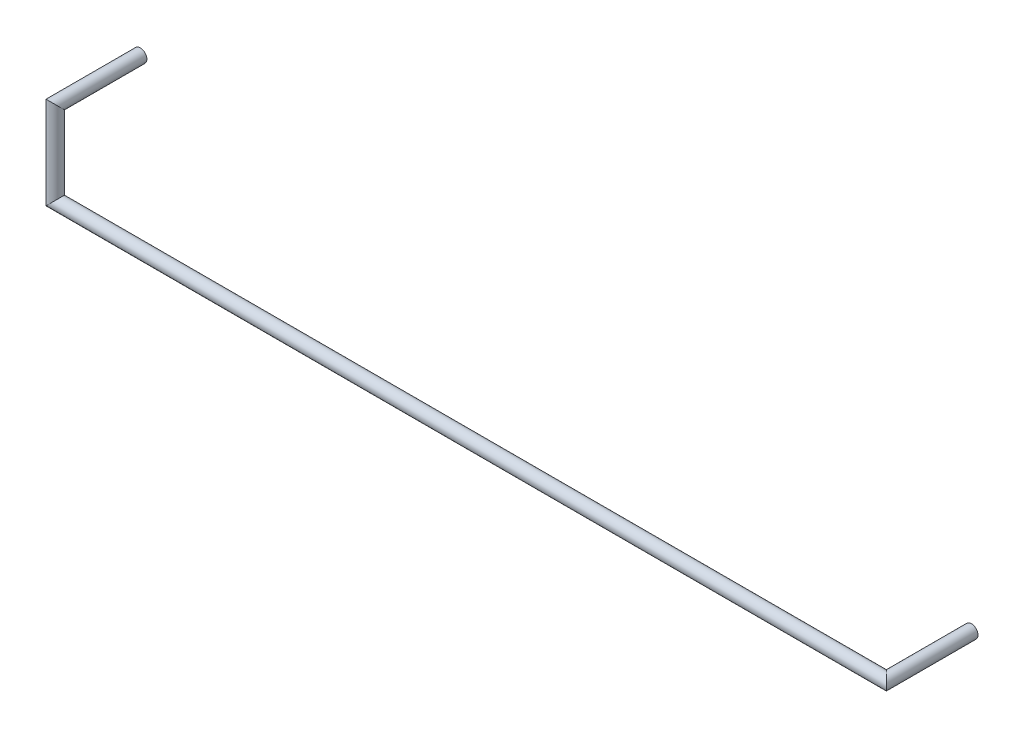
ISO-10303-21;
HEADER;
FILE_DESCRIPTION(('STEP AP214'),'2;1');
FILE_NAME('part.step','',(''),(''),'','','');
FILE_SCHEMA(('AUTOMOTIVE_DESIGN { 1 0 10303 214 1 1 1 1 }'));
ENDSEC;
DATA;
#1=APPLICATION_CONTEXT('core data for automotive mechanical design processes');
#2=APPLICATION_PROTOCOL_DEFINITION('international standard','automotive_design',2000,#1);
#3=PRODUCT_CONTEXT('',#1,'mechanical');
#4=PRODUCT('Part','Part','',(#3));
#5=PRODUCT_RELATED_PRODUCT_CATEGORY('part','',(#4));
#6=PRODUCT_DEFINITION_FORMATION('','',#4);
#7=PRODUCT_DEFINITION_CONTEXT('part definition',#1,'design');
#8=PRODUCT_DEFINITION('design','',#6,#7);
#9=PRODUCT_DEFINITION_SHAPE('','',#8);
#10=(LENGTH_UNIT() NAMED_UNIT(*) SI_UNIT(.MILLI.,.METRE.));
#11=(NAMED_UNIT(*) PLANE_ANGLE_UNIT() SI_UNIT($,.RADIAN.));
#12=(NAMED_UNIT(*) SI_UNIT($,.STERADIAN.) SOLID_ANGLE_UNIT());
#13=UNCERTAINTY_MEASURE_WITH_UNIT(LENGTH_MEASURE(1.E-05),#10,'distance_accuracy_value','');
#14=(GEOMETRIC_REPRESENTATION_CONTEXT(3) GLOBAL_UNCERTAINTY_ASSIGNED_CONTEXT((#13)) GLOBAL_UNIT_ASSIGNED_CONTEXT((#10,
#11,#12)) REPRESENTATION_CONTEXT('',''));
#15=CARTESIAN_POINT('',(0.,0.,0.));
#16=DIRECTION('',(0.,0.,1.));
#17=DIRECTION('',(1.,0.,0.));
#18=AXIS2_PLACEMENT_3D('',#15,#16,#17);
#19=CARTESIAN_POINT('',(25.4,-2.54,0.));
#20=DIRECTION('',(0.,0.,1.));
#21=DIRECTION('',(1.,0.,0.));
#22=AXIS2_PLACEMENT_3D('',#19,#20,#21);
#23=PLANE('',#22);
#24=CARTESIAN_POINT('',(25.4,-2.54,0.));
#25=DIRECTION('',(0.,0.,1.));
#26=DIRECTION('',(1.,0.,0.));
#27=AXIS2_PLACEMENT_3D('',#24,#25,#26);
#28=CIRCLE('',#27,0.199999999999999);
#29=CARTESIAN_POINT('',(25.6,-2.54,0.));
#30=VERTEX_POINT('',#29);
#31=EDGE_CURVE('E52',#30,#30,#28,.T.);
#32=ORIENTED_EDGE('',*,*,#31,.F.);
#33=EDGE_LOOP('',(#32));
#34=FACE_BOUND('',#33,.T.);
#35=ADVANCED_FACE('F49',(#34),#23,.F.);
#36=CARTESIAN_POINT('',(0.,0.,0.));
#37=DIRECTION('',(0.,0.,-1.));
#38=DIRECTION('',(0.,1.,0.));
#39=AXIS2_PLACEMENT_3D('',#36,#37,#38);
#40=PLANE('',#39);
#41=CARTESIAN_POINT('',(0.,0.,0.));
#42=DIRECTION('',(0.,0.,-1.));
#43=DIRECTION('',(0.,1.,0.));
#44=AXIS2_PLACEMENT_3D('',#41,#42,#43);
#45=CIRCLE('',#44,0.199999999999999);
#46=CARTESIAN_POINT('',(0.,0.199999999999999,0.));
#47=VERTEX_POINT('',#46);
#48=EDGE_CURVE('E57',#47,#47,#45,.T.);
#49=ORIENTED_EDGE('',*,*,#48,.T.);
#50=EDGE_LOOP('',(#49));
#51=FACE_BOUND('',#50,.T.);
#52=ADVANCED_FACE('F80',(#51),#40,.T.);
#53=CARTESIAN_POINT('',(25.4,-2.54,2.92));
#54=DIRECTION('',(0.,0.,-1.));
#55=DIRECTION('',(-1.,0.,0.));
#56=AXIS2_PLACEMENT_3D('',#53,#54,#55);
#57=CYLINDRICAL_SURFACE('',#56,0.199999999999999);
#58=CARTESIAN_POINT('',(25.4,-2.54,2.6));
#59=DIRECTION('',(0.707106781186548,0.,-0.707106781186548));
#60=DIRECTION('',(0.707106781186548,0.,0.707106781186548));
#61=AXIS2_PLACEMENT_3D('',#58,#59,#60);
#62=ELLIPSE('',#61,0.282842712474617,0.199999999999999);
#63=CARTESIAN_POINT('',(25.6,-2.54,2.8));
#64=VERTEX_POINT('',#63);
#65=EDGE_CURVE('E68',#64,#64,#62,.T.);
#66=ORIENTED_EDGE('',*,*,#65,.T.);
#67=EDGE_LOOP('',(#66));
#68=FACE_BOUND('',#67,.T.);
#69=ORIENTED_EDGE('',*,*,#31,.T.);
#70=EDGE_LOOP('',(#69));
#71=FACE_BOUND('',#70,.T.);
#72=ADVANCED_FACE('F77',(#68,#71),#57,.T.);
#73=CARTESIAN_POINT('',(-0.539999999999998,-2.54,2.6));
#74=DIRECTION('',(1.,0.,0.));
#75=DIRECTION('',(0.,0.,-1.));
#76=AXIS2_PLACEMENT_3D('',#73,#74,#75);
#77=CYLINDRICAL_SURFACE('',#76,0.199999999999999);
#78=CARTESIAN_POINT('',(0.,-2.54,2.6));
#79=DIRECTION('',(0.707106781186548,-0.707106781186548,0.));
#80=DIRECTION('',(-0.707106781186548,-0.707106781186548,0.));
#81=AXIS2_PLACEMENT_3D('',#78,#79,#80);
#82=ELLIPSE('',#81,0.282842712474617,0.199999999999999);
#83=CARTESIAN_POINT('',(-0.199999999999999,-2.74,2.6));
#84=VERTEX_POINT('',#83);
#85=EDGE_CURVE('E63',#84,#84,#82,.T.);
#86=ORIENTED_EDGE('',*,*,#85,.T.);
#87=EDGE_LOOP('',(#86));
#88=FACE_BOUND('',#87,.T.);
#89=ORIENTED_EDGE('',*,*,#65,.F.);
#90=EDGE_LOOP('',(#89));
#91=FACE_BOUND('',#90,.T.);
#92=ADVANCED_FACE('F93',(#88,#91),#77,.T.);
#93=CARTESIAN_POINT('',(0.,0.319999999999997,2.6));
#94=DIRECTION('',(0.,-1.,0.));
#95=DIRECTION('',(1.,0.,0.));
#96=AXIS2_PLACEMENT_3D('',#93,#94,#95);
#97=CYLINDRICAL_SURFACE('',#96,0.199999999999999);
#98=CARTESIAN_POINT('',(0.,0.,2.6));
#99=DIRECTION('',(0.,-0.707106781186548,0.707106781186548));
#100=DIRECTION('',(0.,0.707106781186548,0.707106781186548));
#101=AXIS2_PLACEMENT_3D('',#98,#99,#100);
#102=ELLIPSE('',#101,0.282842712474617,0.199999999999999);
#103=CARTESIAN_POINT('',(0.,0.199999999999999,2.8));
#104=VERTEX_POINT('',#103);
#105=EDGE_CURVE('E11',#104,#104,#102,.T.);
#106=ORIENTED_EDGE('',*,*,#105,.T.);
#107=EDGE_LOOP('',(#106));
#108=FACE_BOUND('',#107,.T.);
#109=ORIENTED_EDGE('',*,*,#85,.F.);
#110=EDGE_LOOP('',(#109));
#111=FACE_BOUND('',#110,.T.);
#112=ADVANCED_FACE('F87',(#108,#111),#97,.T.);
#113=CARTESIAN_POINT('',(0.,0.,0.));
#114=DIRECTION('',(0.,0.,1.));
#115=DIRECTION('',(1.,0.,0.));
#116=AXIS2_PLACEMENT_3D('',#113,#114,#115);
#117=CYLINDRICAL_SURFACE('',#116,0.199999999999999);
#118=ORIENTED_EDGE('',*,*,#48,.F.);
#119=EDGE_LOOP('',(#118));
#120=FACE_BOUND('',#119,.T.);
#121=ORIENTED_EDGE('',*,*,#105,.F.);
#122=EDGE_LOOP('',(#121));
#123=FACE_BOUND('',#122,.T.);
#124=ADVANCED_FACE('F85',(#120,#123),#117,.T.);
#125=CLOSED_SHELL('',(#35,#52,#72,#92,#112,#124));
#126=MANIFOLD_SOLID_BREP('B2',#125);
#127=ADVANCED_BREP_SHAPE_REPRESENTATION('',(#18,#126),#14);
#128=SHAPE_DEFINITION_REPRESENTATION(#9,#127);
ENDSEC;
END-ISO-10303-21;
